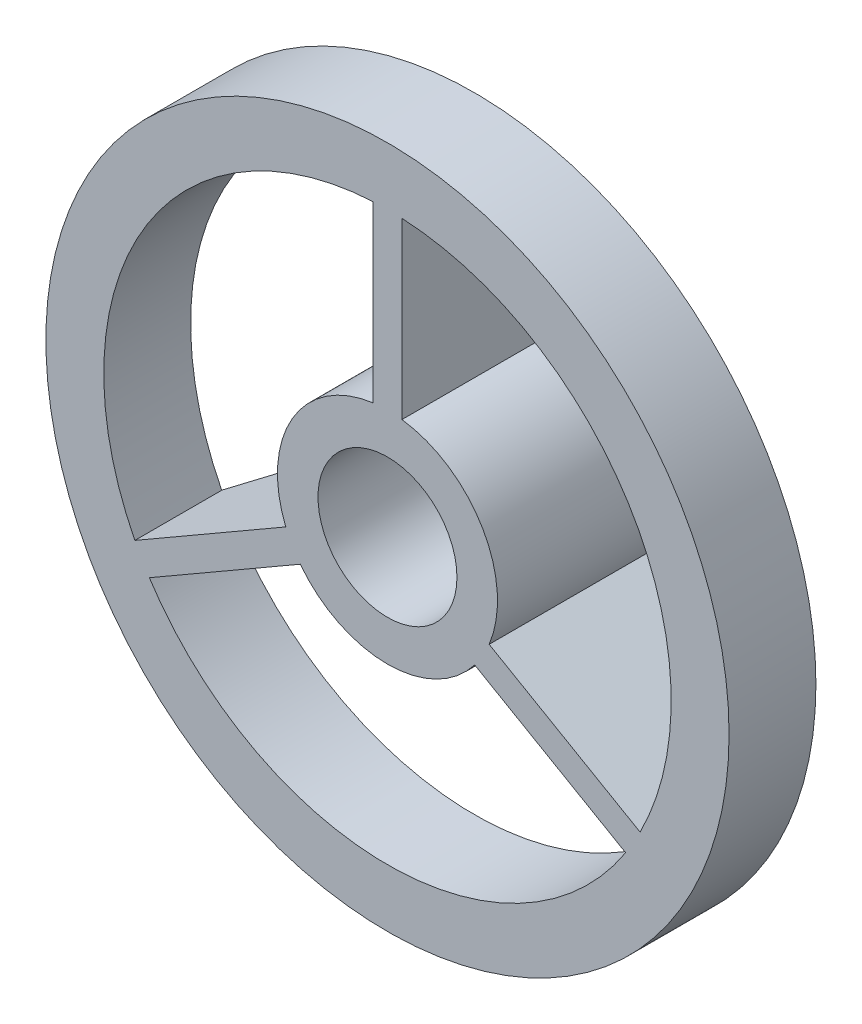
ISO-10303-21;
HEADER;
FILE_DESCRIPTION(('STEP AP214'),'2;1');
FILE_NAME('part.step','',(''),(''),'','','');
FILE_SCHEMA(('AUTOMOTIVE_DESIGN { 1 0 10303 214 1 1 1 1 }'));
ENDSEC;
DATA;
#1=APPLICATION_CONTEXT('core data for automotive mechanical design processes');
#2=APPLICATION_PROTOCOL_DEFINITION('international standard','automotive_design',2000,#1);
#3=PRODUCT_CONTEXT('',#1,'mechanical');
#4=PRODUCT('Part','Part','',(#3));
#5=PRODUCT_RELATED_PRODUCT_CATEGORY('part','',(#4));
#6=PRODUCT_DEFINITION_FORMATION('','',#4);
#7=PRODUCT_DEFINITION_CONTEXT('part definition',#1,'design');
#8=PRODUCT_DEFINITION('design','',#6,#7);
#9=PRODUCT_DEFINITION_SHAPE('','',#8);
#10=(LENGTH_UNIT() NAMED_UNIT(*) SI_UNIT(.MILLI.,.METRE.));
#11=(NAMED_UNIT(*) PLANE_ANGLE_UNIT() SI_UNIT($,.RADIAN.));
#12=(NAMED_UNIT(*) SI_UNIT($,.STERADIAN.) SOLID_ANGLE_UNIT());
#13=UNCERTAINTY_MEASURE_WITH_UNIT(LENGTH_MEASURE(1.E-05),#10,'distance_accuracy_value','');
#14=(GEOMETRIC_REPRESENTATION_CONTEXT(3) GLOBAL_UNCERTAINTY_ASSIGNED_CONTEXT((#13)) GLOBAL_UNIT_ASSIGNED_CONTEXT((#10,
#11,#12)) REPRESENTATION_CONTEXT('',''));
#15=CARTESIAN_POINT('',(0.,0.,0.));
#16=DIRECTION('',(0.,0.,1.));
#17=DIRECTION('',(1.,0.,0.));
#18=AXIS2_PLACEMENT_3D('',#15,#16,#17);
#19=CARTESIAN_POINT('',(0.,0.,2.));
#20=DIRECTION('',(0.,0.,1.));
#21=DIRECTION('',(1.,0.,0.));
#22=AXIS2_PLACEMENT_3D('',#19,#20,#21);
#23=PLANE('',#22);
#24=CARTESIAN_POINT('',(0.,0.,2.));
#25=DIRECTION('',(0.,0.,1.));
#26=DIRECTION('',(1.,0.,0.));
#27=AXIS2_PLACEMENT_3D('',#24,#25,#26);
#28=CIRCLE('',#27,5.9);
#29=CARTESIAN_POINT('',(5.9,0.,2.));
#30=VERTEX_POINT('',#29);
#31=EDGE_CURVE('E239',#30,#30,#28,.T.);
#32=ORIENTED_EDGE('',*,*,#31,.F.);
#33=EDGE_LOOP('',(#32));
#34=FACE_BOUND('',#33,.T.);
#35=CARTESIAN_POINT('',(0.,0.,2.));
#36=DIRECTION('',(0.,0.,1.));
#37=DIRECTION('',(1.,0.,0.));
#38=AXIS2_PLACEMENT_3D('',#35,#36,#37);
#39=CIRCLE('',#38,4.9);
#40=CARTESIAN_POINT('',(-0.25,4.89361829324683,2.));
#41=VERTEX_POINT('',#40);
#42=CARTESIAN_POINT('',(-4.36299775837602,-2.23030279567726,2.));
#43=VERTEX_POINT('',#42);
#44=EDGE_CURVE('E230',#41,#43,#39,.T.);
#45=ORIENTED_EDGE('',*,*,#44,.T.);
#46=DIRECTION('',(-0.866025403784443,-0.499999999999992,0.));
#47=VECTOR('',#46,1.);
#48=CARTESIAN_POINT('',(-0.124999999999998,0.216506350946111,2.));
#49=LINE('',#48,#47);
#50=CARTESIAN_POINT('',(-4.36852447854377,-2.23349364905385,2.));
#51=VERTEX_POINT('',#50);
#52=EDGE_CURVE('E193',#43,#51,#49,.T.);
#53=ORIENTED_EDGE('',*,*,#52,.T.);
#54=DIRECTION('',(0.499999999999992,-0.866025403784443,0.));
#55=VECTOR('',#54,1.);
#56=CARTESIAN_POINT('',(-4.36852447854377,-2.23349364905385,2.));
#57=LINE('',#56,#55);
#58=CARTESIAN_POINT('',(-4.11852447854377,-2.66650635094607,2.));
#59=VERTEX_POINT('',#58);
#60=EDGE_CURVE('E47',#51,#59,#57,.T.);
#61=ORIENTED_EDGE('',*,*,#60,.T.);
#62=DIRECTION('',(-0.866025403784443,-0.499999999999992,0.));
#63=VECTOR('',#62,1.);
#64=CARTESIAN_POINT('',(0.124999999999998,-0.216506350946111,2.));
#65=LINE('',#64,#63);
#66=CARTESIAN_POINT('',(-4.11299775837602,-2.66331549756949,2.));
#67=VERTEX_POINT('',#66);
#68=EDGE_CURVE('E176',#67,#59,#65,.T.);
#69=ORIENTED_EDGE('',*,*,#68,.F.);
#70=CARTESIAN_POINT('',(4.11299775837599,-2.66331549756954,2.));
#71=VERTEX_POINT('',#70);
#72=EDGE_CURVE('E234',#67,#71,#39,.T.);
#73=ORIENTED_EDGE('',*,*,#72,.T.);
#74=DIRECTION('',(0.866025403784436,-0.500000000000004,0.));
#75=VECTOR('',#74,1.);
#76=CARTESIAN_POINT('',(-0.125000000000001,-0.216506350946109,2.));
#77=LINE('',#76,#75);
#78=CARTESIAN_POINT('',(4.11852447854374,-2.66650635094613,2.));
#79=VERTEX_POINT('',#78);
#80=EDGE_CURVE('E223',#71,#79,#77,.T.);
#81=ORIENTED_EDGE('',*,*,#80,.T.);
#82=DIRECTION('',(0.500000000000004,0.866025403784436,0.));
#83=VECTOR('',#82,1.);
#84=CARTESIAN_POINT('',(4.11852447854374,-2.66650635094613,2.));
#85=LINE('',#84,#83);
#86=CARTESIAN_POINT('',(4.36852447854374,-2.23349364905391,2.));
#87=VERTEX_POINT('',#86);
#88=EDGE_CURVE('E206',#79,#87,#85,.T.);
#89=ORIENTED_EDGE('',*,*,#88,.T.);
#90=DIRECTION('',(0.866025403784436,-0.500000000000004,0.));
#91=VECTOR('',#90,1.);
#92=CARTESIAN_POINT('',(0.125000000000001,0.216506350946109,2.));
#93=LINE('',#92,#91);
#94=CARTESIAN_POINT('',(4.36299775837599,-2.23030279567732,2.));
#95=VERTEX_POINT('',#94);
#96=EDGE_CURVE('E217',#95,#87,#93,.T.);
#97=ORIENTED_EDGE('',*,*,#96,.F.);
#98=CARTESIAN_POINT('',(0.25,4.89361829324683,2.));
#99=VERTEX_POINT('',#98);
#100=EDGE_CURVE('E235',#95,#99,#39,.T.);
#101=ORIENTED_EDGE('',*,*,#100,.T.);
#102=DIRECTION('',(0.,-1.,0.));
#103=VECTOR('',#102,1.);
#104=CARTESIAN_POINT('',(0.25,0.,2.));
#105=LINE('',#104,#103);
#106=CARTESIAN_POINT('',(0.25,4.9,2.));
#107=VERTEX_POINT('',#106);
#108=EDGE_CURVE('E249',#107,#99,#105,.T.);
#109=ORIENTED_EDGE('',*,*,#108,.F.);
#110=DIRECTION('',(-1.,0.,0.));
#111=VECTOR('',#110,1.);
#112=CARTESIAN_POINT('',(0.25,4.9,2.));
#113=LINE('',#112,#111);
#114=CARTESIAN_POINT('',(-0.25,4.9,2.));
#115=VERTEX_POINT('',#114);
#116=EDGE_CURVE('E264',#107,#115,#113,.T.);
#117=ORIENTED_EDGE('',*,*,#116,.T.);
#118=DIRECTION('',(0.,-1.,0.));
#119=VECTOR('',#118,1.);
#120=CARTESIAN_POINT('',(-0.25,0.,2.));
#121=LINE('',#120,#119);
#122=EDGE_CURVE('E252',#115,#41,#121,.T.);
#123=ORIENTED_EDGE('',*,*,#122,.T.);
#124=EDGE_LOOP('',(#45,#53,#61,#69,#73,#81,#89,#97,#101,#109,#117,#123));
#125=FACE_BOUND('',#124,.T.);
#126=ADVANCED_FACE('F32',(#34,#125),#23,.F.);
#127=CARTESIAN_POINT('',(0.,0.,3.5));
#128=DIRECTION('',(0.,0.,-1.));
#129=DIRECTION('',(-1.,0.,0.));
#130=AXIS2_PLACEMENT_3D('',#127,#128,#129);
#131=CYLINDRICAL_SURFACE('',#130,1.9);
#132=DIRECTION('',(0.,0.,-1.));
#133=VECTOR('',#132,1.);
#134=CARTESIAN_POINT('',(-1.50614223781988,-1.15824676103796,3.5));
#135=LINE('',#134,#133);
#136=CARTESIAN_POINT('',(-1.50614223781988,-1.15824676103796,0.));
#137=VERTEX_POINT('',#136);
#138=CARTESIAN_POINT('',(-1.50614223781988,-1.15824676103796,3.5));
#139=VERTEX_POINT('',#138);
#140=EDGE_CURVE('E190',#137,#139,#135,.F.);
#141=ORIENTED_EDGE('',*,*,#140,.F.);
#142=CARTESIAN_POINT('',(0.,0.,0.));
#143=DIRECTION('',(0.,0.,1.));
#144=DIRECTION('',(1.,0.,0.));
#145=AXIS2_PLACEMENT_3D('',#142,#143,#144);
#146=CIRCLE('',#145,1.9);
#147=CARTESIAN_POINT('',(1.50614223781986,-1.15824676103798,0.));
#148=VERTEX_POINT('',#147);
#149=EDGE_CURVE('E289',#137,#148,#146,.T.);
#150=ORIENTED_EDGE('',*,*,#149,.T.);
#151=DIRECTION('',(0.,0.,-1.));
#152=VECTOR('',#151,1.);
#153=CARTESIAN_POINT('',(1.50614223781986,-1.15824676103798,3.5));
#154=LINE('',#153,#152);
#155=CARTESIAN_POINT('',(1.50614223781986,-1.15824676103798,3.5));
#156=VERTEX_POINT('',#155);
#157=EDGE_CURVE('E226',#148,#156,#154,.F.);
#158=ORIENTED_EDGE('',*,*,#157,.T.);
#159=CARTESIAN_POINT('',(0.,0.,3.5));
#160=DIRECTION('',(0.,0.,1.));
#161=DIRECTION('',(1.,0.,0.));
#162=AXIS2_PLACEMENT_3D('',#159,#160,#161);
#163=CIRCLE('',#162,1.9);
#164=EDGE_CURVE('E285',#139,#156,#163,.T.);
#165=ORIENTED_EDGE('',*,*,#164,.F.);
#166=EDGE_LOOP('',(#141,#150,#158,#165));
#167=FACE_BOUND('',#166,.T.);
#168=ADVANCED_FACE('F325',(#167),#131,.T.);
#169=CARTESIAN_POINT('',(0.,0.,2.));
#170=DIRECTION('',(0.,0.,1.));
#171=DIRECTION('',(1.,0.,0.));
#172=AXIS2_PLACEMENT_3D('',#169,#170,#171);
#173=CYLINDRICAL_SURFACE('',#172,4.9);
#174=DIRECTION('',(0.,0.,1.));
#175=VECTOR('',#174,1.);
#176=CARTESIAN_POINT('',(-4.11299775837602,-2.66331549756949,2.));
#177=LINE('',#176,#175);
#178=CARTESIAN_POINT('',(-4.11299775837602,-2.66331549756949,3.5));
#179=VERTEX_POINT('',#178);
#180=EDGE_CURVE('E40',#179,#67,#177,.F.);
#181=ORIENTED_EDGE('',*,*,#180,.F.);
#182=CARTESIAN_POINT('',(0.,0.,3.5));
#183=DIRECTION('',(0.,0.,1.));
#184=DIRECTION('',(1.,0.,0.));
#185=AXIS2_PLACEMENT_3D('',#182,#183,#184);
#186=CIRCLE('',#185,4.9);
#187=CARTESIAN_POINT('',(4.11299775837599,-2.66331549756954,3.5));
#188=VERTEX_POINT('',#187);
#189=EDGE_CURVE('E238',#179,#188,#186,.T.);
#190=ORIENTED_EDGE('',*,*,#189,.T.);
#191=DIRECTION('',(0.,0.,1.));
#192=VECTOR('',#191,1.);
#193=CARTESIAN_POINT('',(4.11299775837599,-2.66331549756954,2.));
#194=LINE('',#193,#192);
#195=EDGE_CURVE('E298',#188,#71,#194,.F.);
#196=ORIENTED_EDGE('',*,*,#195,.T.);
#197=ORIENTED_EDGE('',*,*,#72,.F.);
#198=EDGE_LOOP('',(#181,#190,#196,#197));
#199=FACE_BOUND('',#198,.T.);
#200=ADVANCED_FACE('F306',(#199),#173,.F.);
#201=DIRECTION('',(0.,0.,-1.));
#202=VECTOR('',#201,1.);
#203=CARTESIAN_POINT('',(1.75614223781986,-0.725234059145767,3.5));
#204=LINE('',#203,#202);
#205=CARTESIAN_POINT('',(1.75614223781986,-0.725234059145766,0.));
#206=VERTEX_POINT('',#205);
#207=CARTESIAN_POINT('',(1.75614223781986,-0.725234059145767,3.5));
#208=VERTEX_POINT('',#207);
#209=EDGE_CURVE('E220',#206,#208,#204,.F.);
#210=ORIENTED_EDGE('',*,*,#209,.F.);
#211=CARTESIAN_POINT('',(0.25,1.88348082018374,0.));
#212=VERTEX_POINT('',#211);
#213=EDGE_CURVE('E278',#206,#212,#146,.T.);
#214=ORIENTED_EDGE('',*,*,#213,.T.);
#215=DIRECTION('',(0.,0.,-1.));
#216=VECTOR('',#215,1.);
#217=CARTESIAN_POINT('',(0.25,1.88348082018374,3.5));
#218=LINE('',#217,#216);
#219=CARTESIAN_POINT('',(0.25,1.88348082018374,3.5));
#220=VERTEX_POINT('',#219);
#221=EDGE_CURVE('E292',#212,#220,#218,.F.);
#222=ORIENTED_EDGE('',*,*,#221,.T.);
#223=EDGE_CURVE('E286',#208,#220,#163,.T.);
#224=ORIENTED_EDGE('',*,*,#223,.F.);
#225=EDGE_LOOP('',(#210,#214,#222,#224));
#226=FACE_BOUND('',#225,.T.);
#227=ADVANCED_FACE('F337',(#226),#131,.T.);
#228=DIRECTION('',(0.,0.,1.));
#229=VECTOR('',#228,1.);
#230=CARTESIAN_POINT('',(4.36299775837599,-2.23030279567732,2.));
#231=LINE('',#230,#229);
#232=CARTESIAN_POINT('',(4.36299775837599,-2.23030279567732,3.5));
#233=VERTEX_POINT('',#232);
#234=EDGE_CURVE('E295',#233,#95,#231,.F.);
#235=ORIENTED_EDGE('',*,*,#234,.F.);
#236=CARTESIAN_POINT('',(0.25,4.89361829324683,3.5));
#237=VERTEX_POINT('',#236);
#238=EDGE_CURVE('E229',#233,#237,#186,.T.);
#239=ORIENTED_EDGE('',*,*,#238,.T.);
#240=DIRECTION('',(0.,0.,1.));
#241=VECTOR('',#240,1.);
#242=CARTESIAN_POINT('',(0.25,4.89361829324683,2.));
#243=LINE('',#242,#241);
#244=EDGE_CURVE('E246',#99,#237,#243,.T.);
#245=ORIENTED_EDGE('',*,*,#244,.F.);
#246=ORIENTED_EDGE('',*,*,#100,.F.);
#247=EDGE_LOOP('',(#235,#239,#245,#246));
#248=FACE_BOUND('',#247,.T.);
#249=ADVANCED_FACE('F315',(#248),#173,.F.);
#250=CARTESIAN_POINT('',(0.25,0.,0.));
#251=DIRECTION('',(1.,0.,0.));
#252=DIRECTION('',(0.,0.,-1.));
#253=AXIS2_PLACEMENT_3D('',#250,#251,#252);
#254=PLANE('',#253);
#255=DIRECTION('',(0.,0.832050294337844,0.554700196225229));
#256=VECTOR('',#255,1.);
#257=CARTESIAN_POINT('',(0.25,4.9,2.));
#258=LINE('',#257,#256);
#259=CARTESIAN_POINT('',(0.25,1.9,0.));
#260=VERTEX_POINT('',#259);
#261=EDGE_CURVE('E261',#260,#107,#258,.T.);
#262=ORIENTED_EDGE('',*,*,#261,.T.);
#263=ORIENTED_EDGE('',*,*,#108,.T.);
#264=ORIENTED_EDGE('',*,*,#244,.T.);
#265=DIRECTION('',(0.,-1.,0.));
#266=VECTOR('',#265,1.);
#267=CARTESIAN_POINT('',(0.25,4.9,3.5));
#268=LINE('',#267,#266);
#269=EDGE_CURVE('E255',#237,#220,#268,.T.);
#270=ORIENTED_EDGE('',*,*,#269,.T.);
#271=ORIENTED_EDGE('',*,*,#221,.F.);
#272=DIRECTION('',(0.,1.,0.));
#273=VECTOR('',#272,1.);
#274=CARTESIAN_POINT('',(0.25,1.9,0.));
#275=LINE('',#274,#273);
#276=EDGE_CURVE('E258',#212,#260,#275,.T.);
#277=ORIENTED_EDGE('',*,*,#276,.T.);
#278=EDGE_LOOP('',(#262,#263,#264,#270,#271,#277));
#279=FACE_BOUND('',#278,.T.);
#280=ADVANCED_FACE('F319',(#279),#254,.T.);
#281=CARTESIAN_POINT('',(-0.25,0.,0.));
#282=DIRECTION('',(1.,0.,0.));
#283=DIRECTION('',(0.,0.,-1.));
#284=AXIS2_PLACEMENT_3D('',#281,#282,#283);
#285=PLANE('',#284);
#286=ORIENTED_EDGE('',*,*,#122,.F.);
#287=DIRECTION('',(0.,0.832050294337844,0.554700196225229));
#288=VECTOR('',#287,1.);
#289=CARTESIAN_POINT('',(-0.25,4.9,2.));
#290=LINE('',#289,#288);
#291=CARTESIAN_POINT('',(-0.25,1.9,0.));
#292=VERTEX_POINT('',#291);
#293=EDGE_CURVE('E259',#292,#115,#290,.T.);
#294=ORIENTED_EDGE('',*,*,#293,.F.);
#295=DIRECTION('',(0.,1.,0.));
#296=VECTOR('',#295,1.);
#297=CARTESIAN_POINT('',(-0.25,1.9,0.));
#298=LINE('',#297,#296);
#299=CARTESIAN_POINT('',(-0.25,1.88348082018374,0.));
#300=VERTEX_POINT('',#299);
#301=EDGE_CURVE('E266',#300,#292,#298,.T.);
#302=ORIENTED_EDGE('',*,*,#301,.F.);
#303=DIRECTION('',(0.,0.,-1.));
#304=VECTOR('',#303,1.);
#305=CARTESIAN_POINT('',(-0.25,1.88348082018374,3.5));
#306=LINE('',#305,#304);
#307=CARTESIAN_POINT('',(-0.25,1.88348082018374,3.5));
#308=VERTEX_POINT('',#307);
#309=EDGE_CURVE('E284',#300,#308,#306,.F.);
#310=ORIENTED_EDGE('',*,*,#309,.T.);
#311=DIRECTION('',(0.,-1.,0.));
#312=VECTOR('',#311,1.);
#313=CARTESIAN_POINT('',(-0.25,1.9,3.5));
#314=LINE('',#313,#312);
#315=CARTESIAN_POINT('',(-0.25,4.89361829324683,3.5));
#316=VERTEX_POINT('',#315);
#317=EDGE_CURVE('E254',#316,#308,#314,.T.);
#318=ORIENTED_EDGE('',*,*,#317,.F.);
#319=DIRECTION('',(0.,0.,1.));
#320=VECTOR('',#319,1.);
#321=CARTESIAN_POINT('',(-0.25,4.89361829324683,2.));
#322=LINE('',#321,#320);
#323=EDGE_CURVE('E242',#41,#316,#322,.T.);
#324=ORIENTED_EDGE('',*,*,#323,.F.);
#325=EDGE_LOOP('',(#286,#294,#302,#310,#318,#324));
#326=FACE_BOUND('',#325,.T.);
#327=ADVANCED_FACE('F350',(#326),#285,.F.);
#328=CARTESIAN_POINT('',(0.,0.,3.5));
#329=DIRECTION('',(0.,0.,1.));
#330=DIRECTION('',(1.,0.,0.));
#331=AXIS2_PLACEMENT_3D('',#328,#329,#330);
#332=PLANE('',#331);
#333=CARTESIAN_POINT('',(-1.75614223781987,-0.725234059145742,3.5));
#334=VERTEX_POINT('',#333);
#335=EDGE_CURVE('E281',#308,#334,#163,.T.);
#336=ORIENTED_EDGE('',*,*,#335,.T.);
#337=DIRECTION('',(0.866025403784443,0.499999999999992,0.));
#338=VECTOR('',#337,1.);
#339=CARTESIAN_POINT('',(-4.36852447854377,-2.23349364905385,3.5));
#340=LINE('',#339,#338);
#341=CARTESIAN_POINT('',(-4.36299775837602,-2.23030279567726,3.5));
#342=VERTEX_POINT('',#341);
#343=EDGE_CURVE('E166',#342,#334,#340,.T.);
#344=ORIENTED_EDGE('',*,*,#343,.F.);
#345=EDGE_CURVE('E236',#316,#342,#186,.T.);
#346=ORIENTED_EDGE('',*,*,#345,.F.);
#347=ORIENTED_EDGE('',*,*,#317,.T.);
#348=EDGE_LOOP('',(#336,#344,#346,#347));
#349=FACE_BOUND('',#348,.T.);
#350=DIRECTION('',(0.866025403784443,0.499999999999992,0.));
#351=VECTOR('',#350,1.);
#352=CARTESIAN_POINT('',(-1.52044826719044,-1.1665063509461,3.5));
#353=LINE('',#352,#351);
#354=EDGE_CURVE('E183',#179,#139,#353,.T.);
#355=ORIENTED_EDGE('',*,*,#354,.T.);
#356=ORIENTED_EDGE('',*,*,#164,.T.);
#357=DIRECTION('',(-0.866025403784436,0.500000000000004,0.));
#358=VECTOR('',#357,1.);
#359=CARTESIAN_POINT('',(4.11852447854374,-2.66650635094613,3.5));
#360=LINE('',#359,#358);
#361=EDGE_CURVE('E197',#188,#156,#360,.T.);
#362=ORIENTED_EDGE('',*,*,#361,.F.);
#363=ORIENTED_EDGE('',*,*,#189,.F.);
#364=EDGE_LOOP('',(#355,#356,#362,#363));
#365=FACE_BOUND('',#364,.T.);
#366=DIRECTION('',(-0.866025403784436,0.500000000000004,0.));
#367=VECTOR('',#366,1.);
#368=CARTESIAN_POINT('',(1.77044826719043,-0.733493649053899,3.5));
#369=LINE('',#368,#367);
#370=EDGE_CURVE('E196',#233,#208,#369,.T.);
#371=ORIENTED_EDGE('',*,*,#370,.T.);
#372=ORIENTED_EDGE('',*,*,#223,.T.);
#373=ORIENTED_EDGE('',*,*,#269,.F.);
#374=ORIENTED_EDGE('',*,*,#238,.F.);
#375=EDGE_LOOP('',(#371,#372,#373,#374));
#376=FACE_BOUND('',#375,.T.);
#377=CARTESIAN_POINT('',(0.,0.,3.5));
#378=DIRECTION('',(0.,0.,1.));
#379=DIRECTION('',(1.,0.,0.));
#380=AXIS2_PLACEMENT_3D('',#377,#378,#379);
#381=CIRCLE('',#380,5.9);
#382=CARTESIAN_POINT('',(5.9,0.,3.5));
#383=VERTEX_POINT('',#382);
#384=EDGE_CURVE('E233',#383,#383,#381,.T.);
#385=ORIENTED_EDGE('',*,*,#384,.T.);
#386=EDGE_LOOP('',(#385));
#387=FACE_BOUND('',#386,.T.);
#388=CARTESIAN_POINT('',(0.,0.,3.5));
#389=DIRECTION('',(0.,0.,1.));
#390=DIRECTION('',(1.,0.,0.));
#391=AXIS2_PLACEMENT_3D('',#388,#389,#390);
#392=CIRCLE('',#391,1.2);
#393=CARTESIAN_POINT('',(1.2,0.,3.5));
#394=VERTEX_POINT('',#393);
#395=EDGE_CURVE('E275',#394,#394,#392,.T.);
#396=ORIENTED_EDGE('',*,*,#395,.F.);
#397=EDGE_LOOP('',(#396));
#398=FACE_BOUND('',#397,.T.);
#399=ADVANCED_FACE('F310',(#349,#365,#376,#387,#398),#332,.T.);
#400=CARTESIAN_POINT('',(0.,0.,0.));
#401=DIRECTION('',(0.,0.,1.));
#402=DIRECTION('',(1.,0.,0.));
#403=AXIS2_PLACEMENT_3D('',#400,#401,#402);
#404=PLANE('',#403);
#405=DIRECTION('',(-0.866025403784443,-0.499999999999992,0.));
#406=VECTOR('',#405,1.);
#407=CARTESIAN_POINT('',(-1.77044826719044,-0.733493649053874,0.));
#408=LINE('',#407,#406);
#409=CARTESIAN_POINT('',(-1.75614223781987,-0.725234059145742,0.));
#410=VERTEX_POINT('',#409);
#411=CARTESIAN_POINT('',(-1.77044826719044,-0.733493649053874,0.));
#412=VERTEX_POINT('',#411);
#413=EDGE_CURVE('E157',#410,#412,#408,.T.);
#414=ORIENTED_EDGE('',*,*,#413,.F.);
#415=EDGE_CURVE('E287',#300,#410,#146,.T.);
#416=ORIENTED_EDGE('',*,*,#415,.F.);
#417=ORIENTED_EDGE('',*,*,#301,.T.);
#418=DIRECTION('',(-1.,0.,0.));
#419=VECTOR('',#418,1.);
#420=CARTESIAN_POINT('',(0.25,1.9,0.));
#421=LINE('',#420,#419);
#422=EDGE_CURVE('E272',#260,#292,#421,.T.);
#423=ORIENTED_EDGE('',*,*,#422,.F.);
#424=ORIENTED_EDGE('',*,*,#276,.F.);
#425=ORIENTED_EDGE('',*,*,#213,.F.);
#426=DIRECTION('',(0.866025403784436,-0.500000000000004,0.));
#427=VECTOR('',#426,1.);
#428=CARTESIAN_POINT('',(1.77044826719043,-0.733493649053899,0.));
#429=LINE('',#428,#427);
#430=CARTESIAN_POINT('',(1.77044826719043,-0.733493649053899,0.));
#431=VERTEX_POINT('',#430);
#432=EDGE_CURVE('E209',#206,#431,#429,.T.);
#433=ORIENTED_EDGE('',*,*,#432,.T.);
#434=DIRECTION('',(0.500000000000004,0.866025403784436,0.));
#435=VECTOR('',#434,1.);
#436=CARTESIAN_POINT('',(1.52044826719043,-1.16650635094612,0.));
#437=LINE('',#436,#435);
#438=CARTESIAN_POINT('',(1.52044826719043,-1.16650635094612,0.));
#439=VERTEX_POINT('',#438);
#440=EDGE_CURVE('E215',#439,#431,#437,.T.);
#441=ORIENTED_EDGE('',*,*,#440,.F.);
#442=DIRECTION('',(0.866025403784436,-0.500000000000004,0.));
#443=VECTOR('',#442,1.);
#444=CARTESIAN_POINT('',(1.52044826719043,-1.16650635094612,0.));
#445=LINE('',#444,#443);
#446=EDGE_CURVE('E200',#148,#439,#445,.T.);
#447=ORIENTED_EDGE('',*,*,#446,.F.);
#448=ORIENTED_EDGE('',*,*,#149,.F.);
#449=DIRECTION('',(-0.866025403784443,-0.499999999999992,0.));
#450=VECTOR('',#449,1.);
#451=CARTESIAN_POINT('',(-1.52044826719044,-1.1665063509461,0.));
#452=LINE('',#451,#450);
#453=CARTESIAN_POINT('',(-1.52044826719044,-1.1665063509461,0.));
#454=VERTEX_POINT('',#453);
#455=EDGE_CURVE('E174',#137,#454,#452,.T.);
#456=ORIENTED_EDGE('',*,*,#455,.T.);
#457=DIRECTION('',(0.499999999999992,-0.866025403784443,0.));
#458=VECTOR('',#457,1.);
#459=CARTESIAN_POINT('',(-1.77044826719044,-0.733493649053874,0.));
#460=LINE('',#459,#458);
#461=EDGE_CURVE('E169',#412,#454,#460,.T.);
#462=ORIENTED_EDGE('',*,*,#461,.F.);
#463=EDGE_LOOP('',(#414,#416,#417,#423,#424,#425,#433,#441,#447,#448,#456,#462));
#464=FACE_BOUND('',#463,.T.);
#465=CARTESIAN_POINT('',(0.,0.,0.));
#466=DIRECTION('',(0.,0.,1.));
#467=DIRECTION('',(1.,0.,0.));
#468=AXIS2_PLACEMENT_3D('',#465,#466,#467);
#469=CIRCLE('',#468,1.2);
#470=CARTESIAN_POINT('',(1.2,0.,0.));
#471=VERTEX_POINT('',#470);
#472=EDGE_CURVE('E274',#471,#471,#469,.T.);
#473=ORIENTED_EDGE('',*,*,#472,.T.);
#474=EDGE_LOOP('',(#473));
#475=FACE_BOUND('',#474,.T.);
#476=ADVANCED_FACE('F170',(#464,#475),#404,.F.);
#477=ORIENTED_EDGE('',*,*,#415,.T.);
#478=DIRECTION('',(0.,0.,-1.));
#479=VECTOR('',#478,1.);
#480=CARTESIAN_POINT('',(-1.75614223781987,-0.725234059145742,3.5));
#481=LINE('',#480,#479);
#482=EDGE_CURVE('E163',#410,#334,#481,.F.);
#483=ORIENTED_EDGE('',*,*,#482,.T.);
#484=ORIENTED_EDGE('',*,*,#335,.F.);
#485=ORIENTED_EDGE('',*,*,#309,.F.);
#486=EDGE_LOOP('',(#477,#483,#484,#485));
#487=FACE_BOUND('',#486,.T.);
#488=ADVANCED_FACE('F34',(#487),#131,.T.);
#489=CARTESIAN_POINT('',(0.,0.,3.5));
#490=DIRECTION('',(0.,0.,-1.));
#491=DIRECTION('',(-1.,0.,0.));
#492=AXIS2_PLACEMENT_3D('',#489,#490,#491);
#493=CYLINDRICAL_SURFACE('',#492,1.2);
#494=ORIENTED_EDGE('',*,*,#395,.T.);
#495=EDGE_LOOP('',(#494));
#496=FACE_BOUND('',#495,.T.);
#497=ORIENTED_EDGE('',*,*,#472,.F.);
#498=EDGE_LOOP('',(#497));
#499=FACE_BOUND('',#498,.T.);
#500=ADVANCED_FACE('F362',(#496,#499),#493,.F.);
#501=CARTESIAN_POINT('',(0.25,4.9,2.));
#502=DIRECTION('',(0.,-0.554700196225229,0.832050294337844));
#503=DIRECTION('',(0.,-0.832050294337844,-0.554700196225229));
#504=AXIS2_PLACEMENT_3D('',#501,#502,#503);
#505=PLANE('',#504);
#506=ORIENTED_EDGE('',*,*,#293,.T.);
#507=ORIENTED_EDGE('',*,*,#116,.F.);
#508=ORIENTED_EDGE('',*,*,#261,.F.);
#509=ORIENTED_EDGE('',*,*,#422,.T.);
#510=EDGE_LOOP('',(#506,#507,#508,#509));
#511=FACE_BOUND('',#510,.T.);
#512=ADVANCED_FACE('F344',(#511),#505,.F.);
#513=ORIENTED_EDGE('',*,*,#345,.T.);
#514=DIRECTION('',(0.,0.,1.));
#515=VECTOR('',#514,1.);
#516=CARTESIAN_POINT('',(-4.36299775837602,-2.23030279567726,2.));
#517=LINE('',#516,#515);
#518=EDGE_CURVE('E11',#342,#43,#517,.F.);
#519=ORIENTED_EDGE('',*,*,#518,.T.);
#520=ORIENTED_EDGE('',*,*,#44,.F.);
#521=ORIENTED_EDGE('',*,*,#323,.T.);
#522=EDGE_LOOP('',(#513,#519,#520,#521));
#523=FACE_BOUND('',#522,.T.);
#524=ADVANCED_FACE('F355',(#523),#173,.F.);
#525=CARTESIAN_POINT('',(0.,0.,2.));
#526=DIRECTION('',(0.,0.,1.));
#527=DIRECTION('',(1.,0.,0.));
#528=AXIS2_PLACEMENT_3D('',#525,#526,#527);
#529=CYLINDRICAL_SURFACE('',#528,5.9);
#530=ORIENTED_EDGE('',*,*,#31,.T.);
#531=EDGE_LOOP('',(#530));
#532=FACE_BOUND('',#531,.T.);
#533=ORIENTED_EDGE('',*,*,#384,.F.);
#534=EDGE_LOOP('',(#533));
#535=FACE_BOUND('',#534,.T.);
#536=ADVANCED_FACE('F380',(#532,#535),#529,.T.);
#537=CARTESIAN_POINT('',(-0.125000000000001,-0.216506350946109,0.));
#538=DIRECTION('',(-0.500000000000004,-0.866025403784436,0.));
#539=DIRECTION('',(0.,0.,-1.));
#540=AXIS2_PLACEMENT_3D('',#537,#538,#539);
#541=PLANE('',#540);
#542=ORIENTED_EDGE('',*,*,#157,.F.);
#543=ORIENTED_EDGE('',*,*,#446,.T.);
#544=DIRECTION('',(0.72057669212289,-0.416025147168925,0.554700196225229));
#545=VECTOR('',#544,1.);
#546=CARTESIAN_POINT('',(4.11852447854374,-2.66650635094613,2.));
#547=LINE('',#546,#545);
#548=EDGE_CURVE('E203',#439,#79,#547,.T.);
#549=ORIENTED_EDGE('',*,*,#548,.T.);
#550=ORIENTED_EDGE('',*,*,#80,.F.);
#551=ORIENTED_EDGE('',*,*,#195,.F.);
#552=ORIENTED_EDGE('',*,*,#361,.T.);
#553=EDGE_LOOP('',(#542,#543,#549,#550,#551,#552));
#554=FACE_BOUND('',#553,.T.);
#555=ADVANCED_FACE('F328',(#554),#541,.T.);
#556=CARTESIAN_POINT('',(0.125000000000001,0.216506350946109,0.));
#557=DIRECTION('',(-0.500000000000004,-0.866025403784436,0.));
#558=DIRECTION('',(0.,0.,-1.));
#559=AXIS2_PLACEMENT_3D('',#556,#557,#558);
#560=PLANE('',#559);
#561=ORIENTED_EDGE('',*,*,#432,.F.);
#562=ORIENTED_EDGE('',*,*,#209,.T.);
#563=ORIENTED_EDGE('',*,*,#370,.F.);
#564=ORIENTED_EDGE('',*,*,#234,.T.);
#565=ORIENTED_EDGE('',*,*,#96,.T.);
#566=DIRECTION('',(0.72057669212289,-0.416025147168925,0.554700196225229));
#567=VECTOR('',#566,1.);
#568=CARTESIAN_POINT('',(4.36852447854374,-2.23349364905391,2.));
#569=LINE('',#568,#567);
#570=EDGE_CURVE('E201',#431,#87,#569,.T.);
#571=ORIENTED_EDGE('',*,*,#570,.F.);
#572=EDGE_LOOP('',(#561,#562,#563,#564,#565,#571));
#573=FACE_BOUND('',#572,.T.);
#574=ADVANCED_FACE('F335',(#573),#560,.F.);
#575=CARTESIAN_POINT('',(4.11852447854374,-2.66650635094613,2.));
#576=DIRECTION('',(-0.48038446141526,0.277350098112617,0.832050294337844));
#577=DIRECTION('',(0.866025403784439,0.,0.499999999999999));
#578=AXIS2_PLACEMENT_3D('',#575,#576,#577);
#579=PLANE('',#578);
#580=ORIENTED_EDGE('',*,*,#570,.T.);
#581=ORIENTED_EDGE('',*,*,#88,.F.);
#582=ORIENTED_EDGE('',*,*,#548,.F.);
#583=ORIENTED_EDGE('',*,*,#440,.T.);
#584=EDGE_LOOP('',(#580,#581,#582,#583));
#585=FACE_BOUND('',#584,.T.);
#586=ADVANCED_FACE('F432',(#585),#579,.F.);
#587=CARTESIAN_POINT('',(-0.124999999999998,0.216506350946111,0.));
#588=DIRECTION('',(-0.499999999999992,0.866025403784443,0.));
#589=DIRECTION('',(0.,0.,-1.));
#590=AXIS2_PLACEMENT_3D('',#587,#588,#589);
#591=PLANE('',#590);
#592=ORIENTED_EDGE('',*,*,#482,.F.);
#593=ORIENTED_EDGE('',*,*,#413,.T.);
#594=DIRECTION('',(-0.720576692122896,-0.416025147168915,0.554700196225229));
#595=VECTOR('',#594,1.);
#596=CARTESIAN_POINT('',(-4.36852447854377,-2.23349364905385,2.));
#597=LINE('',#596,#595);
#598=EDGE_CURVE('E161',#412,#51,#597,.T.);
#599=ORIENTED_EDGE('',*,*,#598,.T.);
#600=ORIENTED_EDGE('',*,*,#52,.F.);
#601=ORIENTED_EDGE('',*,*,#518,.F.);
#602=ORIENTED_EDGE('',*,*,#343,.T.);
#603=EDGE_LOOP('',(#592,#593,#599,#600,#601,#602));
#604=FACE_BOUND('',#603,.T.);
#605=ADVANCED_FACE('F159',(#604),#591,.T.);
#606=CARTESIAN_POINT('',(0.124999999999998,-0.216506350946111,0.));
#607=DIRECTION('',(-0.499999999999992,0.866025403784443,0.));
#608=DIRECTION('',(0.,0.,-1.));
#609=AXIS2_PLACEMENT_3D('',#606,#607,#608);
#610=PLANE('',#609);
#611=ORIENTED_EDGE('',*,*,#455,.F.);
#612=ORIENTED_EDGE('',*,*,#140,.T.);
#613=ORIENTED_EDGE('',*,*,#354,.F.);
#614=ORIENTED_EDGE('',*,*,#180,.T.);
#615=ORIENTED_EDGE('',*,*,#68,.T.);
#616=DIRECTION('',(-0.720576692122896,-0.416025147168915,0.554700196225229));
#617=VECTOR('',#616,1.);
#618=CARTESIAN_POINT('',(-4.11852447854377,-2.66650635094607,2.));
#619=LINE('',#618,#617);
#620=EDGE_CURVE('E187',#454,#59,#619,.T.);
#621=ORIENTED_EDGE('',*,*,#620,.F.);
#622=EDGE_LOOP('',(#611,#612,#613,#614,#615,#621));
#623=FACE_BOUND('',#622,.T.);
#624=ADVANCED_FACE('F303',(#623),#610,.F.);
#625=CARTESIAN_POINT('',(-4.36852447854377,-2.23349364905385,2.));
#626=DIRECTION('',(0.480384461415264,0.27735009811261,0.832050294337844));
#627=DIRECTION('',(0.866025403784437,0.,-0.500000000000002));
#628=AXIS2_PLACEMENT_3D('',#625,#626,#627);
#629=PLANE('',#628);
#630=ORIENTED_EDGE('',*,*,#620,.T.);
#631=ORIENTED_EDGE('',*,*,#60,.F.);
#632=ORIENTED_EDGE('',*,*,#598,.F.);
#633=ORIENTED_EDGE('',*,*,#461,.T.);
#634=EDGE_LOOP('',(#630,#631,#632,#633));
#635=FACE_BOUND('',#634,.T.);
#636=ADVANCED_FACE('F178',(#635),#629,.F.);
#637=CLOSED_SHELL('',(#126,#168,#200,#227,#249,#280,#327,#399,#476,#488,#500,#512,#524,#536,
#555,#574,#586,#605,#624,#636));
#638=MANIFOLD_SOLID_BREP('B2',#637);
#639=ADVANCED_BREP_SHAPE_REPRESENTATION('',(#18,#638),#14);
#640=SHAPE_DEFINITION_REPRESENTATION(#9,#639);
ENDSEC;
END-ISO-10303-21;
